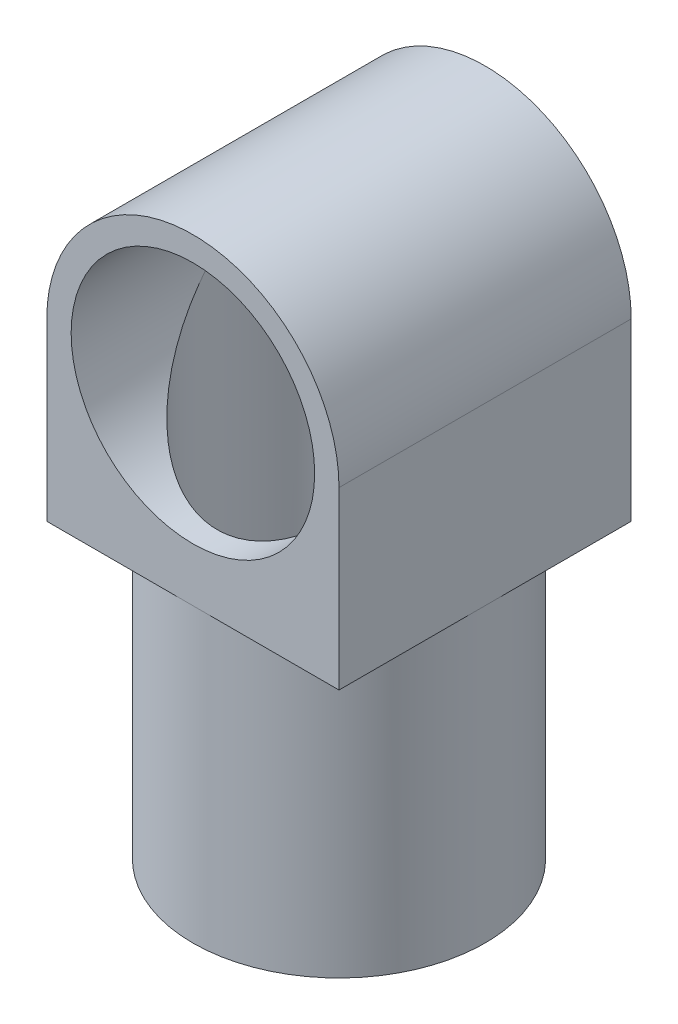
ISO-10303-21;
HEADER;
FILE_DESCRIPTION(('STEP AP214'),'2;1');
FILE_NAME('part.step','',(''),(''),'','','');
FILE_SCHEMA(('AUTOMOTIVE_DESIGN { 1 0 10303 214 1 1 1 1 }'));
ENDSEC;
DATA;
#1=APPLICATION_CONTEXT('core data for automotive mechanical design processes');
#2=APPLICATION_PROTOCOL_DEFINITION('international standard','automotive_design',2000,#1);
#3=PRODUCT_CONTEXT('',#1,'mechanical');
#4=PRODUCT('Part','Part','',(#3));
#5=PRODUCT_RELATED_PRODUCT_CATEGORY('part','',(#4));
#6=PRODUCT_DEFINITION_FORMATION('','',#4);
#7=PRODUCT_DEFINITION_CONTEXT('part definition',#1,'design');
#8=PRODUCT_DEFINITION('design','',#6,#7);
#9=PRODUCT_DEFINITION_SHAPE('','',#8);
#10=(LENGTH_UNIT() NAMED_UNIT(*) SI_UNIT(.MILLI.,.METRE.));
#11=(NAMED_UNIT(*) PLANE_ANGLE_UNIT() SI_UNIT($,.RADIAN.));
#12=(NAMED_UNIT(*) SI_UNIT($,.STERADIAN.) SOLID_ANGLE_UNIT());
#13=UNCERTAINTY_MEASURE_WITH_UNIT(LENGTH_MEASURE(1.E-05),#10,'distance_accuracy_value','');
#14=(GEOMETRIC_REPRESENTATION_CONTEXT(3) GLOBAL_UNCERTAINTY_ASSIGNED_CONTEXT((#13)) GLOBAL_UNIT_ASSIGNED_CONTEXT((#10,
#11,#12)) REPRESENTATION_CONTEXT('',''));
#15=CARTESIAN_POINT('',(0.,0.,0.));
#16=DIRECTION('',(0.,0.,1.));
#17=DIRECTION('',(1.,0.,0.));
#18=AXIS2_PLACEMENT_3D('',#15,#16,#17);
#19=CARTESIAN_POINT('',(0.,-18.,30.));
#20=DIRECTION('',(0.,1.,0.));
#21=DIRECTION('',(0.,0.,1.));
#22=AXIS2_PLACEMENT_3D('',#19,#20,#21);
#23=PLANE('',#22);
#24=CARTESIAN_POINT('',(0.,-18.,15.));
#25=DIRECTION('',(0.,-1.,0.));
#26=DIRECTION('',(0.,0.,-1.));
#27=AXIS2_PLACEMENT_3D('',#24,#25,#26);
#28=CIRCLE('',#27,15.);
#29=CARTESIAN_POINT('',(0.,-18.,0.));
#30=VERTEX_POINT('',#29);
#31=CARTESIAN_POINT('',(15.,-18.,15.));
#32=VERTEX_POINT('',#31);
#33=EDGE_CURVE('E139',#30,#32,#28,.T.);
#34=ORIENTED_EDGE('',*,*,#33,.F.);
#35=DIRECTION('',(1.,0.,0.));
#36=VECTOR('',#35,1.);
#37=CARTESIAN_POINT('',(0.,-18.,0.));
#38=LINE('',#37,#36);
#39=CARTESIAN_POINT('',(15.,-18.,0.));
#40=VERTEX_POINT('',#39);
#41=EDGE_CURVE('E117',#30,#40,#38,.T.);
#42=ORIENTED_EDGE('',*,*,#41,.T.);
#43=DIRECTION('',(0.,0.,-1.));
#44=VECTOR('',#43,1.);
#45=CARTESIAN_POINT('',(15.,-18.,30.));
#46=LINE('',#45,#44);
#47=EDGE_CURVE('E125',#32,#40,#46,.T.);
#48=ORIENTED_EDGE('',*,*,#47,.F.);
#49=EDGE_LOOP('',(#34,#42,#48));
#50=FACE_BOUND('',#49,.T.);
#51=ADVANCED_FACE('F40',(#50),#23,.F.);
#52=CARTESIAN_POINT('',(0.,-18.,30.));
#53=VERTEX_POINT('',#52);
#54=EDGE_CURVE('E96',#32,#53,#28,.T.);
#55=ORIENTED_EDGE('',*,*,#54,.F.);
#56=CARTESIAN_POINT('',(15.,-18.,30.));
#57=VERTEX_POINT('',#56);
#58=EDGE_CURVE('E121',#57,#32,#46,.T.);
#59=ORIENTED_EDGE('',*,*,#58,.F.);
#60=DIRECTION('',(1.,0.,0.));
#61=VECTOR('',#60,1.);
#62=CARTESIAN_POINT('',(0.,-18.,30.));
#63=LINE('',#62,#61);
#64=EDGE_CURVE('E159',#53,#57,#63,.T.);
#65=ORIENTED_EDGE('',*,*,#64,.F.);
#66=EDGE_LOOP('',(#55,#59,#65));
#67=FACE_BOUND('',#66,.T.);
#68=ADVANCED_FACE('F157',(#67),#23,.F.);
#69=CARTESIAN_POINT('',(-15.,-18.,15.));
#70=VERTEX_POINT('',#69);
#71=EDGE_CURVE('E137',#53,#70,#28,.T.);
#72=ORIENTED_EDGE('',*,*,#71,.F.);
#73=CARTESIAN_POINT('',(-15.,-18.,30.));
#74=VERTEX_POINT('',#73);
#75=EDGE_CURVE('E170',#74,#53,#63,.T.);
#76=ORIENTED_EDGE('',*,*,#75,.F.);
#77=DIRECTION('',(0.,0.,-1.));
#78=VECTOR('',#77,1.);
#79=CARTESIAN_POINT('',(-15.,-18.,30.));
#80=LINE('',#79,#78);
#81=EDGE_CURVE('E126',#74,#70,#80,.T.);
#82=ORIENTED_EDGE('',*,*,#81,.T.);
#83=EDGE_LOOP('',(#72,#76,#82));
#84=FACE_BOUND('',#83,.T.);
#85=ADVANCED_FACE('F191',(#84),#23,.F.);
#86=CARTESIAN_POINT('',(15.,0.,30.));
#87=DIRECTION('',(-1.,0.,0.));
#88=DIRECTION('',(0.,0.,1.));
#89=AXIS2_PLACEMENT_3D('',#86,#87,#88);
#90=PLANE('',#89);
#91=DIRECTION('',(0.,1.,0.));
#92=VECTOR('',#91,1.);
#93=CARTESIAN_POINT('',(15.,0.,0.));
#94=LINE('',#93,#92);
#95=CARTESIAN_POINT('',(15.,0.,0.));
#96=VERTEX_POINT('',#95);
#97=EDGE_CURVE('E149',#40,#96,#94,.T.);
#98=ORIENTED_EDGE('',*,*,#97,.T.);
#99=DIRECTION('',(0.,0.,-1.));
#100=VECTOR('',#99,1.);
#101=CARTESIAN_POINT('',(15.,0.,30.));
#102=LINE('',#101,#100);
#103=CARTESIAN_POINT('',(15.,0.,30.));
#104=VERTEX_POINT('',#103);
#105=EDGE_CURVE('E132',#104,#96,#102,.T.);
#106=ORIENTED_EDGE('',*,*,#105,.F.);
#107=DIRECTION('',(0.,1.,0.));
#108=VECTOR('',#107,1.);
#109=CARTESIAN_POINT('',(15.,0.,30.));
#110=LINE('',#109,#108);
#111=EDGE_CURVE('E111',#57,#104,#110,.T.);
#112=ORIENTED_EDGE('',*,*,#111,.F.);
#113=ORIENTED_EDGE('',*,*,#58,.T.);
#114=ORIENTED_EDGE('',*,*,#47,.T.);
#115=EDGE_LOOP('',(#98,#106,#112,#113,#114));
#116=FACE_BOUND('',#115,.T.);
#117=ADVANCED_FACE('F42',(#116),#90,.F.);
#118=CARTESIAN_POINT('',(0.,0.,30.));
#119=DIRECTION('',(0.,0.,-1.));
#120=DIRECTION('',(-1.,0.,0.));
#121=AXIS2_PLACEMENT_3D('',#118,#119,#120);
#122=CYLINDRICAL_SURFACE('',#121,15.);
#123=CARTESIAN_POINT('',(0.,0.,0.));
#124=DIRECTION('',(0.,0.,1.));
#125=DIRECTION('',(1.,0.,0.));
#126=AXIS2_PLACEMENT_3D('',#123,#124,#125);
#127=CIRCLE('',#126,15.);
#128=CARTESIAN_POINT('',(-15.,0.,0.));
#129=VERTEX_POINT('',#128);
#130=EDGE_CURVE('E178',#96,#129,#127,.T.);
#131=ORIENTED_EDGE('',*,*,#130,.T.);
#132=DIRECTION('',(0.,0.,-1.));
#133=VECTOR('',#132,1.);
#134=CARTESIAN_POINT('',(-15.,0.,30.));
#135=LINE('',#134,#133);
#136=CARTESIAN_POINT('',(-15.,0.,30.));
#137=VERTEX_POINT('',#136);
#138=EDGE_CURVE('E129',#137,#129,#135,.T.);
#139=ORIENTED_EDGE('',*,*,#138,.F.);
#140=CARTESIAN_POINT('',(0.,0.,30.));
#141=DIRECTION('',(0.,0.,1.));
#142=DIRECTION('',(1.,0.,0.));
#143=AXIS2_PLACEMENT_3D('',#140,#141,#142);
#144=CIRCLE('',#143,15.);
#145=EDGE_CURVE('E115',#104,#137,#144,.T.);
#146=ORIENTED_EDGE('',*,*,#145,.F.);
#147=ORIENTED_EDGE('',*,*,#105,.T.);
#148=EDGE_LOOP('',(#131,#139,#146,#147));
#149=FACE_BOUND('',#148,.T.);
#150=ADVANCED_FACE('F196',(#149),#122,.T.);
#151=CARTESIAN_POINT('',(-15.,0.,30.));
#152=DIRECTION('',(1.,0.,0.));
#153=DIRECTION('',(0.,0.,-1.));
#154=AXIS2_PLACEMENT_3D('',#151,#152,#153);
#155=PLANE('',#154);
#156=DIRECTION('',(0.,-1.,0.));
#157=VECTOR('',#156,1.);
#158=CARTESIAN_POINT('',(-15.,0.,0.));
#159=LINE('',#158,#157);
#160=CARTESIAN_POINT('',(-15.,-18.,0.));
#161=VERTEX_POINT('',#160);
#162=EDGE_CURVE('E179',#129,#161,#159,.T.);
#163=ORIENTED_EDGE('',*,*,#162,.T.);
#164=EDGE_CURVE('E124',#70,#161,#80,.T.);
#165=ORIENTED_EDGE('',*,*,#164,.F.);
#166=ORIENTED_EDGE('',*,*,#81,.F.);
#167=DIRECTION('',(0.,-1.,0.));
#168=VECTOR('',#167,1.);
#169=CARTESIAN_POINT('',(-15.,0.,30.));
#170=LINE('',#169,#168);
#171=EDGE_CURVE('E171',#137,#74,#170,.T.);
#172=ORIENTED_EDGE('',*,*,#171,.F.);
#173=ORIENTED_EDGE('',*,*,#138,.T.);
#174=EDGE_LOOP('',(#163,#165,#166,#172,#173));
#175=FACE_BOUND('',#174,.T.);
#176=ADVANCED_FACE('F184',(#175),#155,.F.);
#177=EDGE_CURVE('E60',#70,#30,#28,.T.);
#178=ORIENTED_EDGE('',*,*,#177,.F.);
#179=ORIENTED_EDGE('',*,*,#164,.T.);
#180=EDGE_CURVE('E112',#161,#30,#38,.T.);
#181=ORIENTED_EDGE('',*,*,#180,.T.);
#182=EDGE_LOOP('',(#178,#179,#181));
#183=FACE_BOUND('',#182,.T.);
#184=ADVANCED_FACE('F101',(#183),#23,.F.);
#185=CARTESIAN_POINT('',(0.,0.,30.));
#186=DIRECTION('',(0.,0.,-1.));
#187=DIRECTION('',(-1.,0.,0.));
#188=AXIS2_PLACEMENT_3D('',#185,#186,#187);
#189=CYLINDRICAL_SURFACE('',#188,12.5);
#190=CARTESIAN_POINT('',(0.,0.,15.));
#191=DIRECTION('',(0.,-0.707106781186547,-0.707106781186547));
#192=DIRECTION('',(0.,0.707106781186547,-0.707106781186547));
#193=AXIS2_PLACEMENT_3D('',#190,#191,#192);
#194=ELLIPSE('',#193,17.6776695296637,12.5);
#195=CARTESIAN_POINT('',(-12.5,0.,15.));
#196=VERTEX_POINT('',#195);
#197=CARTESIAN_POINT('',(12.5,0.,15.));
#198=VERTEX_POINT('',#197);
#199=EDGE_CURVE('E11',#196,#198,#194,.F.);
#200=ORIENTED_EDGE('',*,*,#199,.F.);
#201=CARTESIAN_POINT('',(0.,0.,15.));
#202=DIRECTION('',(0.,0.707106781186547,-0.707106781186547));
#203=DIRECTION('',(0.,-0.707106781186547,-0.707106781186547));
#204=AXIS2_PLACEMENT_3D('',#201,#202,#203);
#205=ELLIPSE('',#204,17.6776695296637,12.5);
#206=EDGE_CURVE('E48',#198,#196,#205,.T.);
#207=ORIENTED_EDGE('',*,*,#206,.F.);
#208=EDGE_LOOP('',(#200,#207));
#209=FACE_BOUND('',#208,.T.);
#210=CARTESIAN_POINT('',(0.,0.,30.));
#211=DIRECTION('',(0.,0.,1.));
#212=DIRECTION('',(1.,0.,0.));
#213=AXIS2_PLACEMENT_3D('',#210,#211,#212);
#214=CIRCLE('',#213,12.5);
#215=CARTESIAN_POINT('',(12.5,0.,30.));
#216=VERTEX_POINT('',#215);
#217=EDGE_CURVE('E106',#216,#216,#214,.T.);
#218=ORIENTED_EDGE('',*,*,#217,.T.);
#219=EDGE_LOOP('',(#218));
#220=FACE_BOUND('',#219,.T.);
#221=CARTESIAN_POINT('',(0.,0.,0.));
#222=DIRECTION('',(0.,0.,1.));
#223=DIRECTION('',(1.,0.,0.));
#224=AXIS2_PLACEMENT_3D('',#221,#222,#223);
#225=CIRCLE('',#224,12.5);
#226=CARTESIAN_POINT('',(12.5,0.,0.));
#227=VERTEX_POINT('',#226);
#228=EDGE_CURVE('E109',#227,#227,#225,.T.);
#229=ORIENTED_EDGE('',*,*,#228,.F.);
#230=EDGE_LOOP('',(#229));
#231=FACE_BOUND('',#230,.T.);
#232=ADVANCED_FACE('F97',(#209,#220,#231),#189,.F.);
#233=CARTESIAN_POINT('',(0.,0.,30.));
#234=DIRECTION('',(0.,0.,1.));
#235=DIRECTION('',(1.,0.,0.));
#236=AXIS2_PLACEMENT_3D('',#233,#234,#235);
#237=PLANE('',#236);
#238=ORIENTED_EDGE('',*,*,#111,.T.);
#239=ORIENTED_EDGE('',*,*,#145,.T.);
#240=ORIENTED_EDGE('',*,*,#171,.T.);
#241=ORIENTED_EDGE('',*,*,#75,.T.);
#242=ORIENTED_EDGE('',*,*,#64,.T.);
#243=EDGE_LOOP('',(#238,#239,#240,#241,#242));
#244=FACE_BOUND('',#243,.T.);
#245=ORIENTED_EDGE('',*,*,#217,.F.);
#246=EDGE_LOOP('',(#245));
#247=FACE_BOUND('',#246,.T.);
#248=ADVANCED_FACE('F100',(#244,#247),#237,.T.);
#249=CARTESIAN_POINT('',(0.,0.,0.));
#250=DIRECTION('',(0.,0.,1.));
#251=DIRECTION('',(1.,0.,0.));
#252=AXIS2_PLACEMENT_3D('',#249,#250,#251);
#253=PLANE('',#252);
#254=ORIENTED_EDGE('',*,*,#97,.F.);
#255=ORIENTED_EDGE('',*,*,#41,.F.);
#256=ORIENTED_EDGE('',*,*,#180,.F.);
#257=ORIENTED_EDGE('',*,*,#162,.F.);
#258=ORIENTED_EDGE('',*,*,#130,.F.);
#259=EDGE_LOOP('',(#254,#255,#256,#257,#258));
#260=FACE_BOUND('',#259,.T.);
#261=ORIENTED_EDGE('',*,*,#228,.T.);
#262=EDGE_LOOP('',(#261));
#263=FACE_BOUND('',#262,.T.);
#264=ADVANCED_FACE('F188',(#260,#263),#253,.F.);
#265=CARTESIAN_POINT('',(0.,-48.,15.));
#266=DIRECTION('',(0.,-1.,0.));
#267=DIRECTION('',(0.,0.,-1.));
#268=AXIS2_PLACEMENT_3D('',#265,#266,#267);
#269=PLANE('',#268);
#270=CARTESIAN_POINT('',(0.,-48.,15.));
#271=DIRECTION('',(0.,-1.,0.));
#272=DIRECTION('',(0.,0.,-1.));
#273=AXIS2_PLACEMENT_3D('',#270,#271,#272);
#274=CIRCLE('',#273,15.);
#275=CARTESIAN_POINT('',(0.,-48.,0.));
#276=VERTEX_POINT('',#275);
#277=EDGE_CURVE('E144',#276,#276,#274,.T.);
#278=ORIENTED_EDGE('',*,*,#277,.T.);
#279=EDGE_LOOP('',(#278));
#280=FACE_BOUND('',#279,.T.);
#281=CARTESIAN_POINT('',(0.,-48.,15.));
#282=DIRECTION('',(0.,-1.,0.));
#283=DIRECTION('',(0.,0.,-1.));
#284=AXIS2_PLACEMENT_3D('',#281,#282,#283);
#285=CIRCLE('',#284,12.5);
#286=CARTESIAN_POINT('',(0.,-48.,2.5));
#287=VERTEX_POINT('',#286);
#288=EDGE_CURVE('E145',#287,#287,#285,.T.);
#289=ORIENTED_EDGE('',*,*,#288,.F.);
#290=EDGE_LOOP('',(#289));
#291=FACE_BOUND('',#290,.T.);
#292=ADVANCED_FACE('F264',(#280,#291),#269,.T.);
#293=CARTESIAN_POINT('',(0.,-48.,15.));
#294=DIRECTION('',(0.,1.,0.));
#295=DIRECTION('',(0.,0.,1.));
#296=AXIS2_PLACEMENT_3D('',#293,#294,#295);
#297=CYLINDRICAL_SURFACE('',#296,15.);
#298=ORIENTED_EDGE('',*,*,#277,.F.);
#299=EDGE_LOOP('',(#298));
#300=FACE_BOUND('',#299,.T.);
#301=ORIENTED_EDGE('',*,*,#33,.T.);
#302=ORIENTED_EDGE('',*,*,#54,.T.);
#303=ORIENTED_EDGE('',*,*,#71,.T.);
#304=ORIENTED_EDGE('',*,*,#177,.T.);
#305=EDGE_LOOP('',(#301,#302,#303,#304));
#306=FACE_BOUND('',#305,.T.);
#307=ADVANCED_FACE('F152',(#300,#306),#297,.T.);
#308=CARTESIAN_POINT('',(0.,-48.,15.));
#309=DIRECTION('',(0.,1.,0.));
#310=DIRECTION('',(0.,0.,1.));
#311=AXIS2_PLACEMENT_3D('',#308,#309,#310);
#312=CYLINDRICAL_SURFACE('',#311,12.5);
#313=ORIENTED_EDGE('',*,*,#288,.T.);
#314=EDGE_LOOP('',(#313));
#315=FACE_BOUND('',#314,.T.);
#316=ORIENTED_EDGE('',*,*,#199,.T.);
#317=ORIENTED_EDGE('',*,*,#206,.T.);
#318=EDGE_LOOP('',(#316,#317));
#319=FACE_BOUND('',#318,.T.);
#320=ADVANCED_FACE('F94',(#315,#319),#312,.F.);
#321=CLOSED_SHELL('',(#51,#68,#85,#117,#150,#176,#184,#232,#248,#264,#292,#307,#320));
#322=MANIFOLD_SOLID_BREP('B2',#321);
#323=ADVANCED_BREP_SHAPE_REPRESENTATION('',(#18,#322),#14);
#324=SHAPE_DEFINITION_REPRESENTATION(#9,#323);
ENDSEC;
END-ISO-10303-21;
